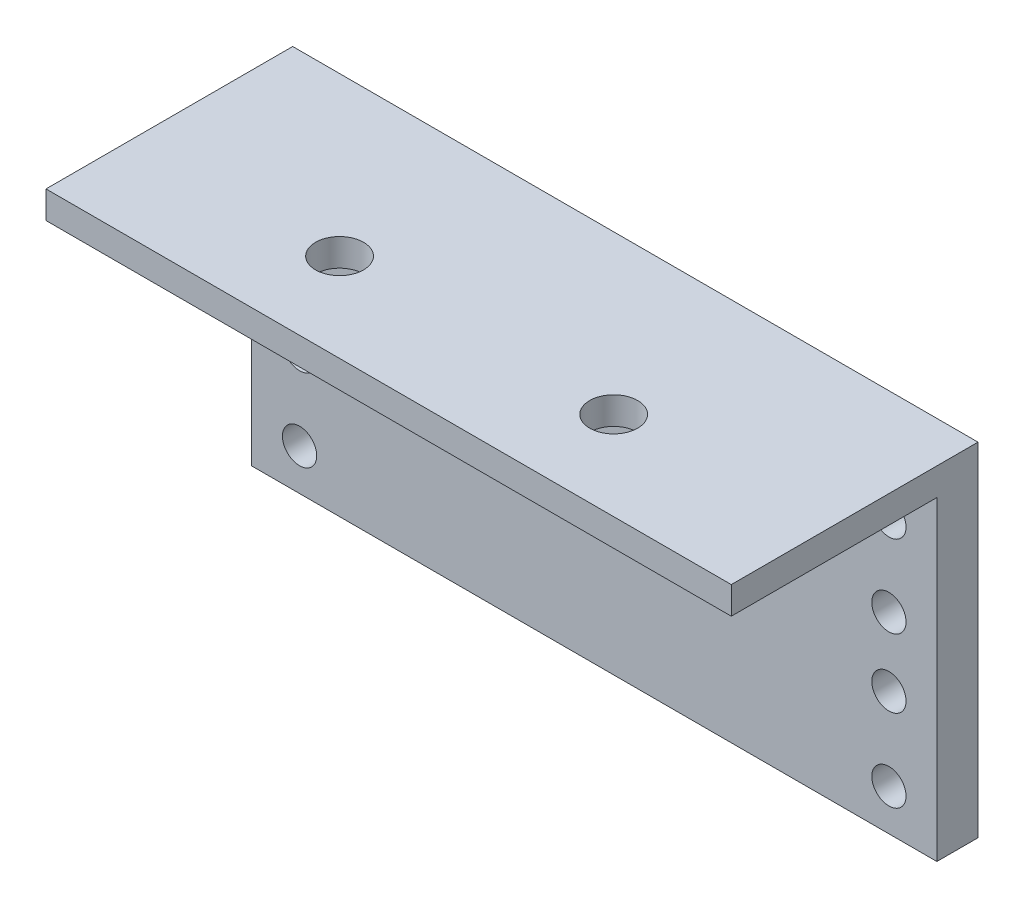
ISO-10303-21;
HEADER;
FILE_DESCRIPTION(('STEP AP214'),'2;1');
FILE_NAME('part.step','',(''),(''),'','','');
FILE_SCHEMA(('AUTOMOTIVE_DESIGN { 1 0 10303 214 1 1 1 1 }'));
ENDSEC;
DATA;
#1=APPLICATION_CONTEXT('core data for automotive mechanical design processes');
#2=APPLICATION_PROTOCOL_DEFINITION('international standard','automotive_design',2000,#1);
#3=PRODUCT_CONTEXT('',#1,'mechanical');
#4=PRODUCT('Part','Part','',(#3));
#5=PRODUCT_RELATED_PRODUCT_CATEGORY('part','',(#4));
#6=PRODUCT_DEFINITION_FORMATION('','',#4);
#7=PRODUCT_DEFINITION_CONTEXT('part definition',#1,'design');
#8=PRODUCT_DEFINITION('design','',#6,#7);
#9=PRODUCT_DEFINITION_SHAPE('','',#8);
#10=(LENGTH_UNIT() NAMED_UNIT(*) SI_UNIT(.MILLI.,.METRE.));
#11=(NAMED_UNIT(*) PLANE_ANGLE_UNIT() SI_UNIT($,.RADIAN.));
#12=(NAMED_UNIT(*) SI_UNIT($,.STERADIAN.) SOLID_ANGLE_UNIT());
#13=UNCERTAINTY_MEASURE_WITH_UNIT(LENGTH_MEASURE(1.E-05),#10,'distance_accuracy_value','');
#14=(GEOMETRIC_REPRESENTATION_CONTEXT(3) GLOBAL_UNCERTAINTY_ASSIGNED_CONTEXT((#13)) GLOBAL_UNIT_ASSIGNED_CONTEXT((#10,
#11,#12)) REPRESENTATION_CONTEXT('',''));
#15=CARTESIAN_POINT('',(0.,0.,0.));
#16=DIRECTION('',(0.,0.,1.));
#17=DIRECTION('',(1.,0.,0.));
#18=AXIS2_PLACEMENT_3D('',#15,#16,#17);
#19=CARTESIAN_POINT('',(0.,0.,3.));
#20=DIRECTION('',(-1.,0.,0.));
#21=DIRECTION('',(0.,-1.,0.));
#22=AXIS2_PLACEMENT_3D('',#19,#20,#21);
#23=PLANE('',#22);
#24=DIRECTION('',(0.,1.,0.));
#25=VECTOR('',#24,1.);
#26=CARTESIAN_POINT('',(0.,0.,0.));
#27=LINE('',#26,#25);
#28=CARTESIAN_POINT('',(0.,0.,0.));
#29=VERTEX_POINT('',#28);
#30=CARTESIAN_POINT('',(0.,25.,0.));
#31=VERTEX_POINT('',#30);
#32=EDGE_CURVE('E102',#29,#31,#27,.T.);
#33=ORIENTED_EDGE('',*,*,#32,.T.);
#34=DIRECTION('',(0.,0.,-1.));
#35=VECTOR('',#34,1.);
#36=CARTESIAN_POINT('',(0.,25.,3.));
#37=LINE('',#36,#35);
#38=CARTESIAN_POINT('',(0.,25.,18.));
#39=VERTEX_POINT('',#38);
#40=EDGE_CURVE('E11',#39,#31,#37,.T.);
#41=ORIENTED_EDGE('',*,*,#40,.F.);
#42=DIRECTION('',(0.,1.,0.));
#43=VECTOR('',#42,1.);
#44=CARTESIAN_POINT('',(0.,25.,18.));
#45=LINE('',#44,#43);
#46=CARTESIAN_POINT('',(0.,23.,18.));
#47=VERTEX_POINT('',#46);
#48=EDGE_CURVE('E216',#47,#39,#45,.T.);
#49=ORIENTED_EDGE('',*,*,#48,.F.);
#50=DIRECTION('',(0.,0.,-1.));
#51=VECTOR('',#50,1.);
#52=CARTESIAN_POINT('',(0.,23.,18.));
#53=LINE('',#52,#51);
#54=CARTESIAN_POINT('',(0.,23.,3.));
#55=VERTEX_POINT('',#54);
#56=EDGE_CURVE('E115',#47,#55,#53,.T.);
#57=ORIENTED_EDGE('',*,*,#56,.T.);
#58=DIRECTION('',(0.,1.,0.));
#59=VECTOR('',#58,1.);
#60=CARTESIAN_POINT('',(0.,0.,3.));
#61=LINE('',#60,#59);
#62=CARTESIAN_POINT('',(0.,0.,3.));
#63=VERTEX_POINT('',#62);
#64=EDGE_CURVE('E96',#63,#55,#61,.T.);
#65=ORIENTED_EDGE('',*,*,#64,.F.);
#66=DIRECTION('',(0.,0.,-1.));
#67=VECTOR('',#66,1.);
#68=CARTESIAN_POINT('',(0.,0.,3.));
#69=LINE('',#68,#67);
#70=EDGE_CURVE('E88',#63,#29,#69,.T.);
#71=ORIENTED_EDGE('',*,*,#70,.T.);
#72=EDGE_LOOP('',(#33,#41,#49,#57,#65,#71));
#73=FACE_BOUND('',#72,.T.);
#74=ADVANCED_FACE('F43',(#73),#23,.F.);
#75=CARTESIAN_POINT('',(0.,25.,3.));
#76=DIRECTION('',(0.,-1.,0.));
#77=DIRECTION('',(1.,0.,0.));
#78=AXIS2_PLACEMENT_3D('',#75,#76,#77);
#79=PLANE('',#78);
#80=CARTESIAN_POINT('',(-35.0461489444719,25.,11.5352174257873));
#81=DIRECTION('',(0.,1.,0.));
#82=DIRECTION('',(-1.,0.,0.));
#83=AXIS2_PLACEMENT_3D('',#80,#81,#82);
#84=CIRCLE('',#83,1.75);
#85=CARTESIAN_POINT('',(-36.7961489444719,25.,11.5352174257873));
#86=VERTEX_POINT('',#85);
#87=EDGE_CURVE('E162',#86,#86,#84,.T.);
#88=ORIENTED_EDGE('',*,*,#87,.F.);
#89=EDGE_LOOP('',(#88));
#90=FACE_BOUND('',#89,.T.);
#91=CARTESIAN_POINT('',(-15.0461489444719,25.,11.5352174257873));
#92=DIRECTION('',(0.,1.,0.));
#93=DIRECTION('',(-1.,0.,0.));
#94=AXIS2_PLACEMENT_3D('',#91,#92,#93);
#95=CIRCLE('',#94,1.75);
#96=CARTESIAN_POINT('',(-16.7961489444719,25.,11.5352174257873));
#97=VERTEX_POINT('',#96);
#98=EDGE_CURVE('E170',#97,#97,#95,.T.);
#99=ORIENTED_EDGE('',*,*,#98,.F.);
#100=EDGE_LOOP('',(#99));
#101=FACE_BOUND('',#100,.T.);
#102=DIRECTION('',(-1.,0.,0.));
#103=VECTOR('',#102,1.);
#104=CARTESIAN_POINT('',(0.,25.,0.));
#105=LINE('',#104,#103);
#106=CARTESIAN_POINT('',(-50.,25.,0.));
#107=VERTEX_POINT('',#106);
#108=EDGE_CURVE('E107',#31,#107,#105,.T.);
#109=ORIENTED_EDGE('',*,*,#108,.T.);
#110=DIRECTION('',(0.,0.,-1.));
#111=VECTOR('',#110,1.);
#112=CARTESIAN_POINT('',(-50.,25.,3.));
#113=LINE('',#112,#111);
#114=CARTESIAN_POINT('',(-50.,25.,18.));
#115=VERTEX_POINT('',#114);
#116=EDGE_CURVE('E52',#115,#107,#113,.T.);
#117=ORIENTED_EDGE('',*,*,#116,.F.);
#118=DIRECTION('',(-1.,0.,0.));
#119=VECTOR('',#118,1.);
#120=CARTESIAN_POINT('',(-50.,25.,18.));
#121=LINE('',#120,#119);
#122=EDGE_CURVE('E220',#39,#115,#121,.T.);
#123=ORIENTED_EDGE('',*,*,#122,.F.);
#124=ORIENTED_EDGE('',*,*,#40,.T.);
#125=EDGE_LOOP('',(#109,#117,#123,#124));
#126=FACE_BOUND('',#125,.T.);
#127=ADVANCED_FACE('F240',(#90,#101,#126),#79,.F.);
#128=CARTESIAN_POINT('',(-50.,0.,3.));
#129=DIRECTION('',(1.,0.,0.));
#130=DIRECTION('',(0.,0.,-1.));
#131=AXIS2_PLACEMENT_3D('',#128,#129,#130);
#132=PLANE('',#131);
#133=DIRECTION('',(0.,-1.,0.));
#134=VECTOR('',#133,1.);
#135=CARTESIAN_POINT('',(-50.,0.,0.));
#136=LINE('',#135,#134);
#137=CARTESIAN_POINT('',(-50.,0.,0.));
#138=VERTEX_POINT('',#137);
#139=EDGE_CURVE('E97',#107,#138,#136,.T.);
#140=ORIENTED_EDGE('',*,*,#139,.T.);
#141=DIRECTION('',(0.,0.,-1.));
#142=VECTOR('',#141,1.);
#143=CARTESIAN_POINT('',(-50.,0.,3.));
#144=LINE('',#143,#142);
#145=CARTESIAN_POINT('',(-50.,0.,3.));
#146=VERTEX_POINT('',#145);
#147=EDGE_CURVE('E91',#146,#138,#144,.T.);
#148=ORIENTED_EDGE('',*,*,#147,.F.);
#149=DIRECTION('',(0.,-1.,0.));
#150=VECTOR('',#149,1.);
#151=CARTESIAN_POINT('',(-50.,0.,3.));
#152=LINE('',#151,#150);
#153=CARTESIAN_POINT('',(-50.,23.,3.));
#154=VERTEX_POINT('',#153);
#155=EDGE_CURVE('E229',#154,#146,#152,.T.);
#156=ORIENTED_EDGE('',*,*,#155,.F.);
#157=DIRECTION('',(0.,0.,-1.));
#158=VECTOR('',#157,1.);
#159=CARTESIAN_POINT('',(-50.,23.,18.));
#160=LINE('',#159,#158);
#161=CARTESIAN_POINT('',(-50.,23.,18.));
#162=VERTEX_POINT('',#161);
#163=EDGE_CURVE('E109',#162,#154,#160,.T.);
#164=ORIENTED_EDGE('',*,*,#163,.F.);
#165=DIRECTION('',(0.,-1.,0.));
#166=VECTOR('',#165,1.);
#167=CARTESIAN_POINT('',(-50.,25.,18.));
#168=LINE('',#167,#166);
#169=EDGE_CURVE('E208',#115,#162,#168,.T.);
#170=ORIENTED_EDGE('',*,*,#169,.F.);
#171=ORIENTED_EDGE('',*,*,#116,.T.);
#172=EDGE_LOOP('',(#140,#148,#156,#164,#170,#171));
#173=FACE_BOUND('',#172,.T.);
#174=ADVANCED_FACE('F235',(#173),#132,.F.);
#175=CARTESIAN_POINT('',(0.,0.,3.));
#176=DIRECTION('',(0.,1.,0.));
#177=DIRECTION('',(-1.,0.,0.));
#178=AXIS2_PLACEMENT_3D('',#175,#176,#177);
#179=PLANE('',#178);
#180=DIRECTION('',(1.,0.,0.));
#181=VECTOR('',#180,1.);
#182=CARTESIAN_POINT('',(0.,0.,0.));
#183=LINE('',#182,#181);
#184=EDGE_CURVE('E85',#138,#29,#183,.T.);
#185=ORIENTED_EDGE('',*,*,#184,.T.);
#186=ORIENTED_EDGE('',*,*,#70,.F.);
#187=DIRECTION('',(1.,0.,0.));
#188=VECTOR('',#187,1.);
#189=CARTESIAN_POINT('',(0.,0.,3.));
#190=LINE('',#189,#188);
#191=EDGE_CURVE('E66',#146,#63,#190,.T.);
#192=ORIENTED_EDGE('',*,*,#191,.F.);
#193=ORIENTED_EDGE('',*,*,#147,.T.);
#194=EDGE_LOOP('',(#185,#186,#192,#193));
#195=FACE_BOUND('',#194,.T.);
#196=ADVANCED_FACE('F87',(#195),#179,.F.);
#197=CARTESIAN_POINT('',(0.,0.,3.));
#198=DIRECTION('',(0.,0.,1.));
#199=DIRECTION('',(1.,0.,0.));
#200=AXIS2_PLACEMENT_3D('',#197,#198,#199);
#201=PLANE('',#200);
#202=CARTESIAN_POINT('',(-3.50014076193071,3.00924033964487,3.));
#203=DIRECTION('',(0.,0.,1.));
#204=DIRECTION('',(1.,0.,0.));
#205=AXIS2_PLACEMENT_3D('',#202,#203,#204);
#206=CIRCLE('',#205,1.25);
#207=CARTESIAN_POINT('',(-2.25014076193071,3.00924033964487,3.));
#208=VERTEX_POINT('',#207);
#209=EDGE_CURVE('E186',#208,#208,#206,.T.);
#210=ORIENTED_EDGE('',*,*,#209,.F.);
#211=EDGE_LOOP('',(#210));
#212=FACE_BOUND('',#211,.T.);
#213=CARTESIAN_POINT('',(-3.50014076193071,14.0092403396449,3.));
#214=DIRECTION('',(0.,0.,1.));
#215=DIRECTION('',(-1.,0.,0.));
#216=AXIS2_PLACEMENT_3D('',#213,#214,#215);
#217=CIRCLE('',#216,1.25);
#218=CARTESIAN_POINT('',(-4.75014076193071,14.0092403396449,3.));
#219=VERTEX_POINT('',#218);
#220=EDGE_CURVE('E190',#219,#219,#217,.T.);
#221=ORIENTED_EDGE('',*,*,#220,.F.);
#222=EDGE_LOOP('',(#221));
#223=FACE_BOUND('',#222,.T.);
#224=CARTESIAN_POINT('',(-46.5001407619307,3.00924033964487,3.));
#225=DIRECTION('',(0.,0.,1.));
#226=DIRECTION('',(1.,0.,0.));
#227=AXIS2_PLACEMENT_3D('',#224,#225,#226);
#228=CIRCLE('',#227,1.25);
#229=CARTESIAN_POINT('',(-45.2501407619307,3.00924033964487,3.));
#230=VERTEX_POINT('',#229);
#231=EDGE_CURVE('E194',#230,#230,#228,.T.);
#232=ORIENTED_EDGE('',*,*,#231,.F.);
#233=EDGE_LOOP('',(#232));
#234=FACE_BOUND('',#233,.T.);
#235=CARTESIAN_POINT('',(-3.50014076193071,20.0092403396449,3.));
#236=DIRECTION('',(0.,0.,1.));
#237=DIRECTION('',(1.,0.,0.));
#238=AXIS2_PLACEMENT_3D('',#235,#236,#237);
#239=CIRCLE('',#238,1.25);
#240=CARTESIAN_POINT('',(-2.25014076193071,20.0092403396449,3.));
#241=VERTEX_POINT('',#240);
#242=EDGE_CURVE('E198',#241,#241,#239,.T.);
#243=ORIENTED_EDGE('',*,*,#242,.F.);
#244=EDGE_LOOP('',(#243));
#245=FACE_BOUND('',#244,.T.);
#246=CARTESIAN_POINT('',(-46.5001407619307,9.00924033964487,3.));
#247=DIRECTION('',(0.,0.,1.));
#248=DIRECTION('',(-1.,0.,0.));
#249=AXIS2_PLACEMENT_3D('',#246,#247,#248);
#250=CIRCLE('',#249,1.25);
#251=CARTESIAN_POINT('',(-47.7501407619307,9.00924033964487,3.));
#252=VERTEX_POINT('',#251);
#253=EDGE_CURVE('E168',#252,#252,#250,.T.);
#254=ORIENTED_EDGE('',*,*,#253,.F.);
#255=EDGE_LOOP('',(#254));
#256=FACE_BOUND('',#255,.T.);
#257=CARTESIAN_POINT('',(-3.50014076193074,9.00924033964487,3.));
#258=DIRECTION('',(0.,0.,1.));
#259=DIRECTION('',(-1.,0.,0.));
#260=AXIS2_PLACEMENT_3D('',#257,#258,#259);
#261=CIRCLE('',#260,1.25);
#262=CARTESIAN_POINT('',(-4.75014076193074,9.00924033964487,3.));
#263=VERTEX_POINT('',#262);
#264=EDGE_CURVE('E181',#263,#263,#261,.T.);
#265=ORIENTED_EDGE('',*,*,#264,.F.);
#266=EDGE_LOOP('',(#265));
#267=FACE_BOUND('',#266,.T.);
#268=CARTESIAN_POINT('',(-46.5001407619307,14.0092403396449,3.));
#269=DIRECTION('',(0.,0.,1.));
#270=DIRECTION('',(-1.,0.,0.));
#271=AXIS2_PLACEMENT_3D('',#268,#269,#270);
#272=CIRCLE('',#271,1.25);
#273=CARTESIAN_POINT('',(-47.7501407619307,14.0092403396449,3.));
#274=VERTEX_POINT('',#273);
#275=EDGE_CURVE('E182',#274,#274,#272,.T.);
#276=ORIENTED_EDGE('',*,*,#275,.F.);
#277=EDGE_LOOP('',(#276));
#278=FACE_BOUND('',#277,.T.);
#279=CARTESIAN_POINT('',(-46.5001407619307,20.0092403396449,3.));
#280=DIRECTION('',(0.,0.,1.));
#281=DIRECTION('',(1.,0.,0.));
#282=AXIS2_PLACEMENT_3D('',#279,#280,#281);
#283=CIRCLE('',#282,1.25);
#284=CARTESIAN_POINT('',(-45.2501407619307,20.0092403396449,3.));
#285=VERTEX_POINT('',#284);
#286=EDGE_CURVE('E132',#285,#285,#283,.T.);
#287=ORIENTED_EDGE('',*,*,#286,.F.);
#288=EDGE_LOOP('',(#287));
#289=FACE_BOUND('',#288,.T.);
#290=DIRECTION('',(1.,0.,0.));
#291=VECTOR('',#290,1.);
#292=CARTESIAN_POINT('',(-50.,23.,3.));
#293=LINE('',#292,#291);
#294=EDGE_CURVE('E60',#154,#55,#293,.T.);
#295=ORIENTED_EDGE('',*,*,#294,.F.);
#296=ORIENTED_EDGE('',*,*,#155,.T.);
#297=ORIENTED_EDGE('',*,*,#191,.T.);
#298=ORIENTED_EDGE('',*,*,#64,.T.);
#299=EDGE_LOOP('',(#295,#296,#297,#298));
#300=FACE_BOUND('',#299,.T.);
#301=ADVANCED_FACE('F232',(#212,#223,#234,#245,#256,#267,#278,#289,#300),#201,.T.);
#302=CARTESIAN_POINT('',(0.,0.,0.));
#303=DIRECTION('',(0.,0.,1.));
#304=DIRECTION('',(1.,0.,0.));
#305=AXIS2_PLACEMENT_3D('',#302,#303,#304);
#306=PLANE('',#305);
#307=CARTESIAN_POINT('',(-3.50014076193071,3.00924033964487,0.));
#308=DIRECTION('',(0.,0.,1.));
#309=DIRECTION('',(1.,0.,0.));
#310=AXIS2_PLACEMENT_3D('',#307,#308,#309);
#311=CIRCLE('',#310,1.25);
#312=CARTESIAN_POINT('',(-2.25014076193071,3.00924033964487,0.));
#313=VERTEX_POINT('',#312);
#314=EDGE_CURVE('E156',#313,#313,#311,.T.);
#315=ORIENTED_EDGE('',*,*,#314,.T.);
#316=EDGE_LOOP('',(#315));
#317=FACE_BOUND('',#316,.T.);
#318=CARTESIAN_POINT('',(-3.50014076193071,14.0092403396449,0.));
#319=DIRECTION('',(0.,0.,1.));
#320=DIRECTION('',(1.,0.,0.));
#321=AXIS2_PLACEMENT_3D('',#318,#319,#320);
#322=CIRCLE('',#321,1.25);
#323=CARTESIAN_POINT('',(-2.25014076193071,14.0092403396449,0.));
#324=VERTEX_POINT('',#323);
#325=EDGE_CURVE('E152',#324,#324,#322,.T.);
#326=ORIENTED_EDGE('',*,*,#325,.T.);
#327=EDGE_LOOP('',(#326));
#328=FACE_BOUND('',#327,.T.);
#329=CARTESIAN_POINT('',(-46.5001407619307,3.00924033964487,0.));
#330=DIRECTION('',(0.,0.,1.));
#331=DIRECTION('',(1.,0.,0.));
#332=AXIS2_PLACEMENT_3D('',#329,#330,#331);
#333=CIRCLE('',#332,1.25);
#334=CARTESIAN_POINT('',(-45.2501407619307,3.00924033964487,0.));
#335=VERTEX_POINT('',#334);
#336=EDGE_CURVE('E148',#335,#335,#333,.T.);
#337=ORIENTED_EDGE('',*,*,#336,.T.);
#338=EDGE_LOOP('',(#337));
#339=FACE_BOUND('',#338,.T.);
#340=CARTESIAN_POINT('',(-3.50014076193071,20.0092403396449,0.));
#341=DIRECTION('',(0.,0.,1.));
#342=DIRECTION('',(1.,0.,0.));
#343=AXIS2_PLACEMENT_3D('',#340,#341,#342);
#344=CIRCLE('',#343,1.25);
#345=CARTESIAN_POINT('',(-2.25014076193071,20.0092403396449,0.));
#346=VERTEX_POINT('',#345);
#347=EDGE_CURVE('E144',#346,#346,#344,.T.);
#348=ORIENTED_EDGE('',*,*,#347,.T.);
#349=EDGE_LOOP('',(#348));
#350=FACE_BOUND('',#349,.T.);
#351=CARTESIAN_POINT('',(-46.5001407619307,9.00924033964487,0.));
#352=DIRECTION('',(0.,0.,1.));
#353=DIRECTION('',(1.,0.,0.));
#354=AXIS2_PLACEMENT_3D('',#351,#352,#353);
#355=CIRCLE('',#354,1.25);
#356=CARTESIAN_POINT('',(-45.2501407619307,9.00924033964487,0.));
#357=VERTEX_POINT('',#356);
#358=EDGE_CURVE('E140',#357,#357,#355,.T.);
#359=ORIENTED_EDGE('',*,*,#358,.T.);
#360=EDGE_LOOP('',(#359));
#361=FACE_BOUND('',#360,.T.);
#362=CARTESIAN_POINT('',(-3.50014076193074,9.00924033964487,0.));
#363=DIRECTION('',(0.,0.,1.));
#364=DIRECTION('',(1.,0.,0.));
#365=AXIS2_PLACEMENT_3D('',#362,#363,#364);
#366=CIRCLE('',#365,1.25);
#367=CARTESIAN_POINT('',(-2.25014076193074,9.00924033964487,0.));
#368=VERTEX_POINT('',#367);
#369=EDGE_CURVE('E136',#368,#368,#366,.T.);
#370=ORIENTED_EDGE('',*,*,#369,.T.);
#371=EDGE_LOOP('',(#370));
#372=FACE_BOUND('',#371,.T.);
#373=CARTESIAN_POINT('',(-46.5001407619307,14.0092403396449,0.));
#374=DIRECTION('',(0.,0.,1.));
#375=DIRECTION('',(1.,0.,0.));
#376=AXIS2_PLACEMENT_3D('',#373,#374,#375);
#377=CIRCLE('',#376,1.25);
#378=CARTESIAN_POINT('',(-45.2501407619307,14.0092403396449,0.));
#379=VERTEX_POINT('',#378);
#380=EDGE_CURVE('E131',#379,#379,#377,.T.);
#381=ORIENTED_EDGE('',*,*,#380,.T.);
#382=EDGE_LOOP('',(#381));
#383=FACE_BOUND('',#382,.T.);
#384=CARTESIAN_POINT('',(-46.5001407619307,20.0092403396449,0.));
#385=DIRECTION('',(0.,0.,1.));
#386=DIRECTION('',(1.,0.,0.));
#387=AXIS2_PLACEMENT_3D('',#384,#385,#386);
#388=CIRCLE('',#387,1.25);
#389=CARTESIAN_POINT('',(-45.2501407619307,20.0092403396449,0.));
#390=VERTEX_POINT('',#389);
#391=EDGE_CURVE('E127',#390,#390,#388,.T.);
#392=ORIENTED_EDGE('',*,*,#391,.T.);
#393=EDGE_LOOP('',(#392));
#394=FACE_BOUND('',#393,.T.);
#395=ORIENTED_EDGE('',*,*,#32,.F.);
#396=ORIENTED_EDGE('',*,*,#184,.F.);
#397=ORIENTED_EDGE('',*,*,#139,.F.);
#398=ORIENTED_EDGE('',*,*,#108,.F.);
#399=EDGE_LOOP('',(#395,#396,#397,#398));
#400=FACE_BOUND('',#399,.T.);
#401=ADVANCED_FACE('F106',(#317,#328,#339,#350,#361,#372,#383,#394,#400),#306,.F.);
#402=CARTESIAN_POINT('',(-50.,23.,18.));
#403=DIRECTION('',(0.,1.,0.));
#404=DIRECTION('',(-1.,0.,0.));
#405=AXIS2_PLACEMENT_3D('',#402,#403,#404);
#406=PLANE('',#405);
#407=CARTESIAN_POINT('',(-35.0461489444719,23.,11.5352174257873));
#408=DIRECTION('',(0.,1.,0.));
#409=DIRECTION('',(-1.,0.,0.));
#410=AXIS2_PLACEMENT_3D('',#407,#408,#409);
#411=CIRCLE('',#410,1.75);
#412=CARTESIAN_POINT('',(-36.7961489444719,23.,11.5352174257873));
#413=VERTEX_POINT('',#412);
#414=EDGE_CURVE('E46',#413,#413,#411,.T.);
#415=ORIENTED_EDGE('',*,*,#414,.T.);
#416=EDGE_LOOP('',(#415));
#417=FACE_BOUND('',#416,.T.);
#418=CARTESIAN_POINT('',(-15.0461489444719,23.,11.5352174257873));
#419=DIRECTION('',(0.,1.,0.));
#420=DIRECTION('',(-1.,0.,0.));
#421=AXIS2_PLACEMENT_3D('',#418,#419,#420);
#422=CIRCLE('',#421,1.75);
#423=CARTESIAN_POINT('',(-16.7961489444719,23.,11.5352174257873));
#424=VERTEX_POINT('',#423);
#425=EDGE_CURVE('E159',#424,#424,#422,.T.);
#426=ORIENTED_EDGE('',*,*,#425,.T.);
#427=EDGE_LOOP('',(#426));
#428=FACE_BOUND('',#427,.T.);
#429=ORIENTED_EDGE('',*,*,#294,.T.);
#430=ORIENTED_EDGE('',*,*,#56,.F.);
#431=DIRECTION('',(1.,0.,0.));
#432=VECTOR('',#431,1.);
#433=CARTESIAN_POINT('',(-50.,23.,18.));
#434=LINE('',#433,#432);
#435=EDGE_CURVE('E212',#162,#47,#434,.T.);
#436=ORIENTED_EDGE('',*,*,#435,.F.);
#437=ORIENTED_EDGE('',*,*,#163,.T.);
#438=EDGE_LOOP('',(#429,#430,#436,#437));
#439=FACE_BOUND('',#438,.T.);
#440=ADVANCED_FACE('F255',(#417,#428,#439),#406,.F.);
#441=CARTESIAN_POINT('',(0.,0.,18.));
#442=DIRECTION('',(0.,0.,1.));
#443=DIRECTION('',(1.,0.,0.));
#444=AXIS2_PLACEMENT_3D('',#441,#442,#443);
#445=PLANE('',#444);
#446=ORIENTED_EDGE('',*,*,#169,.T.);
#447=ORIENTED_EDGE('',*,*,#435,.T.);
#448=ORIENTED_EDGE('',*,*,#48,.T.);
#449=ORIENTED_EDGE('',*,*,#122,.T.);
#450=EDGE_LOOP('',(#446,#447,#448,#449));
#451=FACE_BOUND('',#450,.T.);
#452=ADVANCED_FACE('F244',(#451),#445,.T.);
#453=CARTESIAN_POINT('',(-46.5001407619307,20.0092403396449,-12.));
#454=DIRECTION('',(0.,0.,1.));
#455=DIRECTION('',(1.,0.,0.));
#456=AXIS2_PLACEMENT_3D('',#453,#454,#455);
#457=CYLINDRICAL_SURFACE('',#456,1.25);
#458=ORIENTED_EDGE('',*,*,#286,.T.);
#459=EDGE_LOOP('',(#458));
#460=FACE_BOUND('',#459,.T.);
#461=ORIENTED_EDGE('',*,*,#391,.F.);
#462=EDGE_LOOP('',(#461));
#463=FACE_BOUND('',#462,.T.);
#464=ADVANCED_FACE('F263',(#460,#463),#457,.F.);
#465=CARTESIAN_POINT('',(-46.5001407619307,14.0092403396449,-12.));
#466=DIRECTION('',(0.,0.,1.));
#467=DIRECTION('',(1.,0.,0.));
#468=AXIS2_PLACEMENT_3D('',#465,#466,#467);
#469=CYLINDRICAL_SURFACE('',#468,1.25);
#470=ORIENTED_EDGE('',*,*,#275,.T.);
#471=EDGE_LOOP('',(#470));
#472=FACE_BOUND('',#471,.T.);
#473=ORIENTED_EDGE('',*,*,#380,.F.);
#474=EDGE_LOOP('',(#473));
#475=FACE_BOUND('',#474,.T.);
#476=ADVANCED_FACE('F302',(#472,#475),#469,.F.);
#477=CARTESIAN_POINT('',(-3.50014076193074,9.00924033964487,-12.));
#478=DIRECTION('',(0.,0.,1.));
#479=DIRECTION('',(1.,0.,0.));
#480=AXIS2_PLACEMENT_3D('',#477,#478,#479);
#481=CYLINDRICAL_SURFACE('',#480,1.25);
#482=ORIENTED_EDGE('',*,*,#264,.T.);
#483=EDGE_LOOP('',(#482));
#484=FACE_BOUND('',#483,.T.);
#485=ORIENTED_EDGE('',*,*,#369,.F.);
#486=EDGE_LOOP('',(#485));
#487=FACE_BOUND('',#486,.T.);
#488=ADVANCED_FACE('F309',(#484,#487),#481,.F.);
#489=CARTESIAN_POINT('',(-46.5001407619307,9.00924033964487,-12.));
#490=DIRECTION('',(0.,0.,1.));
#491=DIRECTION('',(1.,0.,0.));
#492=AXIS2_PLACEMENT_3D('',#489,#490,#491);
#493=CYLINDRICAL_SURFACE('',#492,1.25);
#494=ORIENTED_EDGE('',*,*,#253,.T.);
#495=EDGE_LOOP('',(#494));
#496=FACE_BOUND('',#495,.T.);
#497=ORIENTED_EDGE('',*,*,#358,.F.);
#498=EDGE_LOOP('',(#497));
#499=FACE_BOUND('',#498,.T.);
#500=ADVANCED_FACE('F321',(#496,#499),#493,.F.);
#501=CARTESIAN_POINT('',(-3.50014076193071,20.0092403396449,-12.));
#502=DIRECTION('',(0.,0.,1.));
#503=DIRECTION('',(1.,0.,0.));
#504=AXIS2_PLACEMENT_3D('',#501,#502,#503);
#505=CYLINDRICAL_SURFACE('',#504,1.25);
#506=ORIENTED_EDGE('',*,*,#242,.T.);
#507=EDGE_LOOP('',(#506));
#508=FACE_BOUND('',#507,.T.);
#509=ORIENTED_EDGE('',*,*,#347,.F.);
#510=EDGE_LOOP('',(#509));
#511=FACE_BOUND('',#510,.T.);
#512=ADVANCED_FACE('F317',(#508,#511),#505,.F.);
#513=CARTESIAN_POINT('',(-46.5001407619307,3.00924033964487,-12.));
#514=DIRECTION('',(0.,0.,1.));
#515=DIRECTION('',(1.,0.,0.));
#516=AXIS2_PLACEMENT_3D('',#513,#514,#515);
#517=CYLINDRICAL_SURFACE('',#516,1.25);
#518=ORIENTED_EDGE('',*,*,#231,.T.);
#519=EDGE_LOOP('',(#518));
#520=FACE_BOUND('',#519,.T.);
#521=ORIENTED_EDGE('',*,*,#336,.F.);
#522=EDGE_LOOP('',(#521));
#523=FACE_BOUND('',#522,.T.);
#524=ADVANCED_FACE('F313',(#520,#523),#517,.F.);
#525=CARTESIAN_POINT('',(-3.50014076193071,14.0092403396449,-12.));
#526=DIRECTION('',(0.,0.,1.));
#527=DIRECTION('',(1.,0.,0.));
#528=AXIS2_PLACEMENT_3D('',#525,#526,#527);
#529=CYLINDRICAL_SURFACE('',#528,1.25);
#530=ORIENTED_EDGE('',*,*,#220,.T.);
#531=EDGE_LOOP('',(#530));
#532=FACE_BOUND('',#531,.T.);
#533=ORIENTED_EDGE('',*,*,#325,.F.);
#534=EDGE_LOOP('',(#533));
#535=FACE_BOUND('',#534,.T.);
#536=ADVANCED_FACE('F316',(#532,#535),#529,.F.);
#537=CARTESIAN_POINT('',(-3.50014076193071,3.00924033964487,-12.));
#538=DIRECTION('',(0.,0.,1.));
#539=DIRECTION('',(1.,0.,0.));
#540=AXIS2_PLACEMENT_3D('',#537,#538,#539);
#541=CYLINDRICAL_SURFACE('',#540,1.25);
#542=ORIENTED_EDGE('',*,*,#209,.T.);
#543=EDGE_LOOP('',(#542));
#544=FACE_BOUND('',#543,.T.);
#545=ORIENTED_EDGE('',*,*,#314,.F.);
#546=EDGE_LOOP('',(#545));
#547=FACE_BOUND('',#546,.T.);
#548=ADVANCED_FACE('F323',(#544,#547),#541,.F.);
#549=CARTESIAN_POINT('',(-15.0461489444719,10.,11.5352174257873));
#550=DIRECTION('',(0.,1.,0.));
#551=DIRECTION('',(-1.,0.,0.));
#552=AXIS2_PLACEMENT_3D('',#549,#550,#551);
#553=CYLINDRICAL_SURFACE('',#552,1.75);
#554=ORIENTED_EDGE('',*,*,#98,.T.);
#555=EDGE_LOOP('',(#554));
#556=FACE_BOUND('',#555,.T.);
#557=ORIENTED_EDGE('',*,*,#425,.F.);
#558=EDGE_LOOP('',(#557));
#559=FACE_BOUND('',#558,.T.);
#560=ADVANCED_FACE('F326',(#556,#559),#553,.F.);
#561=CARTESIAN_POINT('',(-35.0461489444719,10.,11.5352174257873));
#562=DIRECTION('',(0.,1.,0.));
#563=DIRECTION('',(-1.,0.,0.));
#564=AXIS2_PLACEMENT_3D('',#561,#562,#563);
#565=CYLINDRICAL_SURFACE('',#564,1.75);
#566=ORIENTED_EDGE('',*,*,#87,.T.);
#567=EDGE_LOOP('',(#566));
#568=FACE_BOUND('',#567,.T.);
#569=ORIENTED_EDGE('',*,*,#414,.F.);
#570=EDGE_LOOP('',(#569));
#571=FACE_BOUND('',#570,.T.);
#572=ADVANCED_FACE('F339',(#568,#571),#565,.F.);
#573=CLOSED_SHELL('',(#74,#127,#174,#196,#301,#401,#440,#452,#464,#476,#488,#500,#512,#524,#536,
#548,#560,#572));
#574=MANIFOLD_SOLID_BREP('B2',#573);
#575=ADVANCED_BREP_SHAPE_REPRESENTATION('',(#18,#574),#14);
#576=SHAPE_DEFINITION_REPRESENTATION(#9,#575);
ENDSEC;
END-ISO-10303-21;
